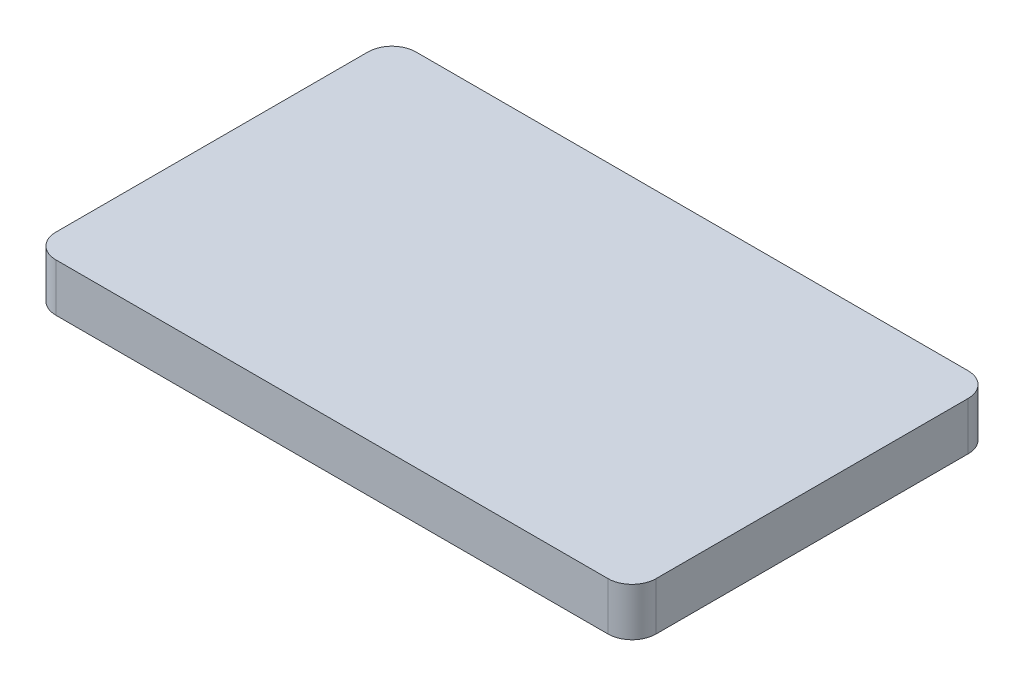
ISO-10303-21;
HEADER;
FILE_DESCRIPTION(('STEP AP214'),'2;1');
FILE_NAME('part.step','',(''),(''),'','','');
FILE_SCHEMA(('AUTOMOTIVE_DESIGN { 1 0 10303 214 1 1 1 1 }'));
ENDSEC;
DATA;
#1=APPLICATION_CONTEXT('core data for automotive mechanical design processes');
#2=APPLICATION_PROTOCOL_DEFINITION('international standard','automotive_design',2000,#1);
#3=PRODUCT_CONTEXT('',#1,'mechanical');
#4=PRODUCT('Part','Part','',(#3));
#5=PRODUCT_RELATED_PRODUCT_CATEGORY('part','',(#4));
#6=PRODUCT_DEFINITION_FORMATION('','',#4);
#7=PRODUCT_DEFINITION_CONTEXT('part definition',#1,'design');
#8=PRODUCT_DEFINITION('design','',#6,#7);
#9=PRODUCT_DEFINITION_SHAPE('','',#8);
#10=(LENGTH_UNIT() NAMED_UNIT(*) SI_UNIT(.MILLI.,.METRE.));
#11=(NAMED_UNIT(*) PLANE_ANGLE_UNIT() SI_UNIT($,.RADIAN.));
#12=(NAMED_UNIT(*) SI_UNIT($,.STERADIAN.) SOLID_ANGLE_UNIT());
#13=UNCERTAINTY_MEASURE_WITH_UNIT(LENGTH_MEASURE(1.E-05),#10,'distance_accuracy_value','');
#14=(GEOMETRIC_REPRESENTATION_CONTEXT(3) GLOBAL_UNCERTAINTY_ASSIGNED_CONTEXT((#13)) GLOBAL_UNIT_ASSIGNED_CONTEXT((#10,
#11,#12)) REPRESENTATION_CONTEXT('',''));
#15=CARTESIAN_POINT('',(0.,0.,0.));
#16=DIRECTION('',(0.,0.,1.));
#17=DIRECTION('',(1.,0.,0.));
#18=AXIS2_PLACEMENT_3D('',#15,#16,#17);
#19=CARTESIAN_POINT('',(125.,20.,75.));
#20=DIRECTION('',(-1.,0.,0.));
#21=DIRECTION('',(0.,0.,1.));
#22=AXIS2_PLACEMENT_3D('',#19,#20,#21);
#23=PLANE('',#22);
#24=DIRECTION('',(0.,0.,-1.));
#25=VECTOR('',#24,1.);
#26=CARTESIAN_POINT('',(125.,0.,75.));
#27=LINE('',#26,#25);
#28=CARTESIAN_POINT('',(125.,0.,65.));
#29=VERTEX_POINT('',#28);
#30=CARTESIAN_POINT('',(125.,0.,-65.));
#31=VERTEX_POINT('',#30);
#32=EDGE_CURVE('E129',#29,#31,#27,.T.);
#33=ORIENTED_EDGE('',*,*,#32,.T.);
#34=DIRECTION('',(0.,-1.,0.));
#35=VECTOR('',#34,1.);
#36=CARTESIAN_POINT('',(125.,20.,-65.));
#37=LINE('',#36,#35);
#38=CARTESIAN_POINT('',(125.,20.,-65.));
#39=VERTEX_POINT('',#38);
#40=EDGE_CURVE('E152',#31,#39,#37,.F.);
#41=ORIENTED_EDGE('',*,*,#40,.T.);
#42=DIRECTION('',(0.,0.,-1.));
#43=VECTOR('',#42,1.);
#44=CARTESIAN_POINT('',(125.,20.,75.));
#45=LINE('',#44,#43);
#46=CARTESIAN_POINT('',(125.,20.,65.));
#47=VERTEX_POINT('',#46);
#48=EDGE_CURVE('E127',#47,#39,#45,.T.);
#49=ORIENTED_EDGE('',*,*,#48,.F.);
#50=DIRECTION('',(0.,-1.,0.));
#51=VECTOR('',#50,1.);
#52=CARTESIAN_POINT('',(125.,20.,65.));
#53=LINE('',#52,#51);
#54=EDGE_CURVE('E149',#47,#29,#53,.T.);
#55=ORIENTED_EDGE('',*,*,#54,.T.);
#56=EDGE_LOOP('',(#33,#41,#49,#55));
#57=FACE_BOUND('',#56,.T.);
#58=ADVANCED_FACE('F34',(#57),#23,.F.);
#59=CARTESIAN_POINT('',(-125.,20.,-75.));
#60=DIRECTION('',(0.,0.,1.));
#61=DIRECTION('',(1.,0.,0.));
#62=AXIS2_PLACEMENT_3D('',#59,#60,#61);
#63=PLANE('',#62);
#64=DIRECTION('',(-1.,0.,0.));
#65=VECTOR('',#64,1.);
#66=CARTESIAN_POINT('',(-125.,0.,-75.));
#67=LINE('',#66,#65);
#68=CARTESIAN_POINT('',(115.,0.,-75.));
#69=VERTEX_POINT('',#68);
#70=CARTESIAN_POINT('',(-115.,0.,-75.));
#71=VERTEX_POINT('',#70);
#72=EDGE_CURVE('E125',#69,#71,#67,.T.);
#73=ORIENTED_EDGE('',*,*,#72,.T.);
#74=DIRECTION('',(0.,-1.,0.));
#75=VECTOR('',#74,1.);
#76=CARTESIAN_POINT('',(-115.,20.,-75.));
#77=LINE('',#76,#75);
#78=CARTESIAN_POINT('',(-115.,20.,-75.));
#79=VERTEX_POINT('',#78);
#80=EDGE_CURVE('E104',#71,#79,#77,.F.);
#81=ORIENTED_EDGE('',*,*,#80,.T.);
#82=DIRECTION('',(-1.,0.,0.));
#83=VECTOR('',#82,1.);
#84=CARTESIAN_POINT('',(-125.,20.,-75.));
#85=LINE('',#84,#83);
#86=CARTESIAN_POINT('',(115.,20.,-75.));
#87=VERTEX_POINT('',#86);
#88=EDGE_CURVE('E168',#87,#79,#85,.T.);
#89=ORIENTED_EDGE('',*,*,#88,.F.);
#90=DIRECTION('',(0.,-1.,0.));
#91=VECTOR('',#90,1.);
#92=CARTESIAN_POINT('',(115.,20.,-75.));
#93=LINE('',#92,#91);
#94=EDGE_CURVE('E109',#87,#69,#93,.T.);
#95=ORIENTED_EDGE('',*,*,#94,.T.);
#96=EDGE_LOOP('',(#73,#81,#89,#95));
#97=FACE_BOUND('',#96,.T.);
#98=ADVANCED_FACE('F185',(#97),#63,.F.);
#99=CARTESIAN_POINT('',(-125.,20.,75.));
#100=DIRECTION('',(1.,0.,0.));
#101=DIRECTION('',(0.,0.,-1.));
#102=AXIS2_PLACEMENT_3D('',#99,#100,#101);
#103=PLANE('',#102);
#104=DIRECTION('',(0.,0.,1.));
#105=VECTOR('',#104,1.);
#106=CARTESIAN_POINT('',(-125.,20.,75.));
#107=LINE('',#106,#105);
#108=CARTESIAN_POINT('',(-125.,20.,-65.));
#109=VERTEX_POINT('',#108);
#110=CARTESIAN_POINT('',(-125.,20.,65.));
#111=VERTEX_POINT('',#110);
#112=EDGE_CURVE('E118',#109,#111,#107,.T.);
#113=ORIENTED_EDGE('',*,*,#112,.F.);
#114=DIRECTION('',(0.,-1.,0.));
#115=VECTOR('',#114,1.);
#116=CARTESIAN_POINT('',(-125.,20.,-65.));
#117=LINE('',#116,#115);
#118=CARTESIAN_POINT('',(-125.,0.,-65.));
#119=VERTEX_POINT('',#118);
#120=EDGE_CURVE('E103',#109,#119,#117,.T.);
#121=ORIENTED_EDGE('',*,*,#120,.T.);
#122=DIRECTION('',(0.,0.,1.));
#123=VECTOR('',#122,1.);
#124=CARTESIAN_POINT('',(-125.,0.,75.));
#125=LINE('',#124,#123);
#126=CARTESIAN_POINT('',(-125.,0.,65.));
#127=VERTEX_POINT('',#126);
#128=EDGE_CURVE('E116',#119,#127,#125,.T.);
#129=ORIENTED_EDGE('',*,*,#128,.T.);
#130=DIRECTION('',(0.,-1.,0.));
#131=VECTOR('',#130,1.);
#132=CARTESIAN_POINT('',(-125.,20.,65.));
#133=LINE('',#132,#131);
#134=EDGE_CURVE('E120',#127,#111,#133,.F.);
#135=ORIENTED_EDGE('',*,*,#134,.T.);
#136=EDGE_LOOP('',(#113,#121,#129,#135));
#137=FACE_BOUND('',#136,.T.);
#138=ADVANCED_FACE('F115',(#137),#103,.F.);
#139=CARTESIAN_POINT('',(-125.,20.,75.));
#140=DIRECTION('',(0.,0.,-1.));
#141=DIRECTION('',(-1.,0.,0.));
#142=AXIS2_PLACEMENT_3D('',#139,#140,#141);
#143=PLANE('',#142);
#144=DIRECTION('',(1.,0.,0.));
#145=VECTOR('',#144,1.);
#146=CARTESIAN_POINT('',(-125.,0.,75.));
#147=LINE('',#146,#145);
#148=CARTESIAN_POINT('',(-115.,0.,75.));
#149=VERTEX_POINT('',#148);
#150=CARTESIAN_POINT('',(115.,0.,75.));
#151=VERTEX_POINT('',#150);
#152=EDGE_CURVE('E124',#149,#151,#147,.T.);
#153=ORIENTED_EDGE('',*,*,#152,.T.);
#154=DIRECTION('',(0.,-1.,0.));
#155=VECTOR('',#154,1.);
#156=CARTESIAN_POINT('',(115.,20.,75.));
#157=LINE('',#156,#155);
#158=CARTESIAN_POINT('',(115.,20.,75.));
#159=VERTEX_POINT('',#158);
#160=EDGE_CURVE('E11',#151,#159,#157,.F.);
#161=ORIENTED_EDGE('',*,*,#160,.T.);
#162=DIRECTION('',(1.,0.,0.));
#163=VECTOR('',#162,1.);
#164=CARTESIAN_POINT('',(-125.,20.,75.));
#165=LINE('',#164,#163);
#166=CARTESIAN_POINT('',(-115.,20.,75.));
#167=VERTEX_POINT('',#166);
#168=EDGE_CURVE('E133',#167,#159,#165,.T.);
#169=ORIENTED_EDGE('',*,*,#168,.F.);
#170=DIRECTION('',(0.,-1.,0.));
#171=VECTOR('',#170,1.);
#172=CARTESIAN_POINT('',(-115.,20.,75.));
#173=LINE('',#172,#171);
#174=EDGE_CURVE('E42',#167,#149,#173,.T.);
#175=ORIENTED_EDGE('',*,*,#174,.T.);
#176=EDGE_LOOP('',(#153,#161,#169,#175));
#177=FACE_BOUND('',#176,.T.);
#178=ADVANCED_FACE('F155',(#177),#143,.F.);
#179=CARTESIAN_POINT('',(0.,20.,0.));
#180=DIRECTION('',(0.,-1.,0.));
#181=DIRECTION('',(0.,0.,-1.));
#182=AXIS2_PLACEMENT_3D('',#179,#180,#181);
#183=PLANE('',#182);
#184=ORIENTED_EDGE('',*,*,#88,.T.);
#185=CARTESIAN_POINT('',(-115.,20.,-65.));
#186=DIRECTION('',(0.,-1.,0.));
#187=DIRECTION('',(0.,0.,-1.));
#188=AXIS2_PLACEMENT_3D('',#185,#186,#187);
#189=CIRCLE('',#188,10.);
#190=EDGE_CURVE('E147',#79,#109,#189,.F.);
#191=ORIENTED_EDGE('',*,*,#190,.T.);
#192=ORIENTED_EDGE('',*,*,#112,.T.);
#193=CARTESIAN_POINT('',(-115.,20.,65.));
#194=DIRECTION('',(0.,-1.,0.));
#195=DIRECTION('',(0.,0.,-1.));
#196=AXIS2_PLACEMENT_3D('',#193,#194,#195);
#197=CIRCLE('',#196,10.);
#198=EDGE_CURVE('E54',#111,#167,#197,.F.);
#199=ORIENTED_EDGE('',*,*,#198,.T.);
#200=ORIENTED_EDGE('',*,*,#168,.T.);
#201=CARTESIAN_POINT('',(115.,20.,65.));
#202=DIRECTION('',(0.,-1.,0.));
#203=DIRECTION('',(0.,0.,-1.));
#204=AXIS2_PLACEMENT_3D('',#201,#202,#203);
#205=CIRCLE('',#204,10.);
#206=EDGE_CURVE('E143',#159,#47,#205,.F.);
#207=ORIENTED_EDGE('',*,*,#206,.T.);
#208=ORIENTED_EDGE('',*,*,#48,.T.);
#209=CARTESIAN_POINT('',(115.,20.,-65.));
#210=DIRECTION('',(0.,-1.,0.));
#211=DIRECTION('',(0.,0.,-1.));
#212=AXIS2_PLACEMENT_3D('',#209,#210,#211);
#213=CIRCLE('',#212,10.);
#214=EDGE_CURVE('E145',#39,#87,#213,.F.);
#215=ORIENTED_EDGE('',*,*,#214,.T.);
#216=EDGE_LOOP('',(#184,#191,#192,#199,#200,#207,#208,#215));
#217=FACE_BOUND('',#216,.T.);
#218=ADVANCED_FACE('F174',(#217),#183,.F.);
#219=CARTESIAN_POINT('',(0.,0.,0.));
#220=DIRECTION('',(0.,-1.,0.));
#221=DIRECTION('',(0.,0.,-1.));
#222=AXIS2_PLACEMENT_3D('',#219,#220,#221);
#223=PLANE('',#222);
#224=ORIENTED_EDGE('',*,*,#128,.F.);
#225=CARTESIAN_POINT('',(-115.,0.,-65.));
#226=DIRECTION('',(0.,-1.,0.));
#227=DIRECTION('',(0.,0.,-1.));
#228=AXIS2_PLACEMENT_3D('',#225,#226,#227);
#229=CIRCLE('',#228,10.);
#230=EDGE_CURVE('E99',#119,#71,#229,.T.);
#231=ORIENTED_EDGE('',*,*,#230,.T.);
#232=ORIENTED_EDGE('',*,*,#72,.F.);
#233=CARTESIAN_POINT('',(115.,0.,-65.));
#234=DIRECTION('',(0.,-1.,0.));
#235=DIRECTION('',(0.,0.,-1.));
#236=AXIS2_PLACEMENT_3D('',#233,#234,#235);
#237=CIRCLE('',#236,10.);
#238=EDGE_CURVE('E110',#69,#31,#237,.T.);
#239=ORIENTED_EDGE('',*,*,#238,.T.);
#240=ORIENTED_EDGE('',*,*,#32,.F.);
#241=CARTESIAN_POINT('',(115.,0.,65.));
#242=DIRECTION('',(0.,-1.,0.));
#243=DIRECTION('',(0.,0.,-1.));
#244=AXIS2_PLACEMENT_3D('',#241,#242,#243);
#245=CIRCLE('',#244,10.);
#246=EDGE_CURVE('E136',#29,#151,#245,.T.);
#247=ORIENTED_EDGE('',*,*,#246,.T.);
#248=ORIENTED_EDGE('',*,*,#152,.F.);
#249=CARTESIAN_POINT('',(-115.,0.,65.));
#250=DIRECTION('',(0.,-1.,0.));
#251=DIRECTION('',(0.,0.,-1.));
#252=AXIS2_PLACEMENT_3D('',#249,#250,#251);
#253=CIRCLE('',#252,10.);
#254=EDGE_CURVE('E119',#149,#127,#253,.T.);
#255=ORIENTED_EDGE('',*,*,#254,.T.);
#256=EDGE_LOOP('',(#224,#231,#232,#239,#240,#247,#248,#255));
#257=FACE_BOUND('',#256,.T.);
#258=ADVANCED_FACE('F122',(#257),#223,.T.);
#259=CARTESIAN_POINT('',(-115.,20.,-65.));
#260=DIRECTION('',(0.,-1.,0.));
#261=DIRECTION('',(0.,0.,-1.));
#262=AXIS2_PLACEMENT_3D('',#259,#260,#261);
#263=CYLINDRICAL_SURFACE('',#262,10.);
#264=ORIENTED_EDGE('',*,*,#190,.F.);
#265=ORIENTED_EDGE('',*,*,#80,.F.);
#266=ORIENTED_EDGE('',*,*,#230,.F.);
#267=ORIENTED_EDGE('',*,*,#120,.F.);
#268=EDGE_LOOP('',(#264,#265,#266,#267));
#269=FACE_BOUND('',#268,.T.);
#270=ADVANCED_FACE('F102',(#269),#263,.T.);
#271=CARTESIAN_POINT('',(115.,20.,-65.));
#272=DIRECTION('',(0.,-1.,0.));
#273=DIRECTION('',(0.,0.,-1.));
#274=AXIS2_PLACEMENT_3D('',#271,#272,#273);
#275=CYLINDRICAL_SURFACE('',#274,10.);
#276=ORIENTED_EDGE('',*,*,#214,.F.);
#277=ORIENTED_EDGE('',*,*,#40,.F.);
#278=ORIENTED_EDGE('',*,*,#238,.F.);
#279=ORIENTED_EDGE('',*,*,#94,.F.);
#280=EDGE_LOOP('',(#276,#277,#278,#279));
#281=FACE_BOUND('',#280,.T.);
#282=ADVANCED_FACE('F196',(#281),#275,.T.);
#283=CARTESIAN_POINT('',(115.,20.,65.));
#284=DIRECTION('',(0.,-1.,0.));
#285=DIRECTION('',(0.,0.,-1.));
#286=AXIS2_PLACEMENT_3D('',#283,#284,#285);
#287=CYLINDRICAL_SURFACE('',#286,10.);
#288=ORIENTED_EDGE('',*,*,#206,.F.);
#289=ORIENTED_EDGE('',*,*,#160,.F.);
#290=ORIENTED_EDGE('',*,*,#246,.F.);
#291=ORIENTED_EDGE('',*,*,#54,.F.);
#292=EDGE_LOOP('',(#288,#289,#290,#291));
#293=FACE_BOUND('',#292,.T.);
#294=ADVANCED_FACE('F162',(#293),#287,.T.);
#295=CARTESIAN_POINT('',(-115.,20.,65.));
#296=DIRECTION('',(0.,-1.,0.));
#297=DIRECTION('',(0.,0.,-1.));
#298=AXIS2_PLACEMENT_3D('',#295,#296,#297);
#299=CYLINDRICAL_SURFACE('',#298,10.);
#300=ORIENTED_EDGE('',*,*,#198,.F.);
#301=ORIENTED_EDGE('',*,*,#134,.F.);
#302=ORIENTED_EDGE('',*,*,#254,.F.);
#303=ORIENTED_EDGE('',*,*,#174,.F.);
#304=EDGE_LOOP('',(#300,#301,#302,#303));
#305=FACE_BOUND('',#304,.T.);
#306=ADVANCED_FACE('F36',(#305),#299,.T.);
#307=CLOSED_SHELL('',(#58,#98,#138,#178,#218,#258,#270,#282,#294,#306));
#308=MANIFOLD_SOLID_BREP('B2',#307);
#309=ADVANCED_BREP_SHAPE_REPRESENTATION('',(#18,#308),#14);
#310=SHAPE_DEFINITION_REPRESENTATION(#9,#309);
ENDSEC;
END-ISO-10303-21;
